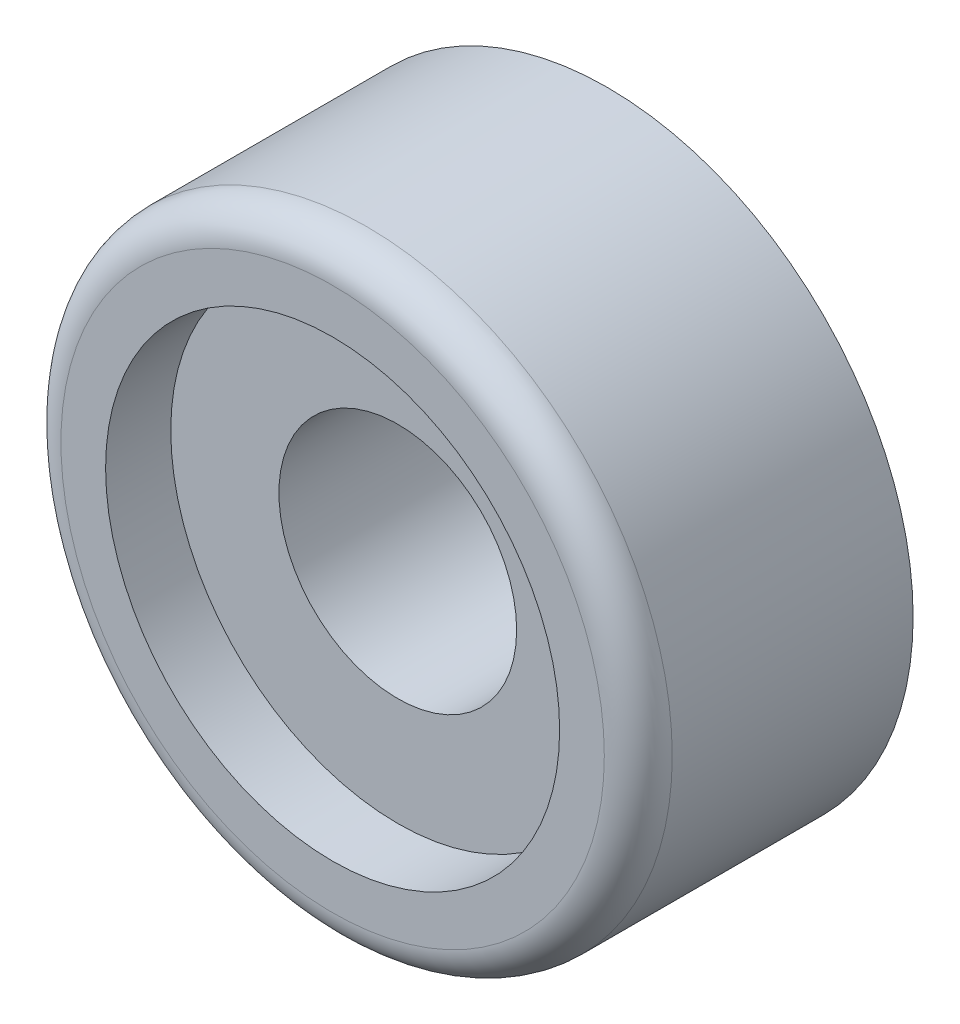
ISO-10303-21;
HEADER;
FILE_DESCRIPTION(('STEP AP214'),'2;1');
FILE_NAME('part.step','',(''),(''),'','','');
FILE_SCHEMA(('AUTOMOTIVE_DESIGN { 1 0 10303 214 1 1 1 1 }'));
ENDSEC;
DATA;
#1=APPLICATION_CONTEXT('core data for automotive mechanical design processes');
#2=APPLICATION_PROTOCOL_DEFINITION('international standard','automotive_design',2000,#1);
#3=PRODUCT_CONTEXT('',#1,'mechanical');
#4=PRODUCT('Part','Part','',(#3));
#5=PRODUCT_RELATED_PRODUCT_CATEGORY('part','',(#4));
#6=PRODUCT_DEFINITION_FORMATION('','',#4);
#7=PRODUCT_DEFINITION_CONTEXT('part definition',#1,'design');
#8=PRODUCT_DEFINITION('design','',#6,#7);
#9=PRODUCT_DEFINITION_SHAPE('','',#8);
#10=(LENGTH_UNIT() NAMED_UNIT(*) SI_UNIT(.MILLI.,.METRE.));
#11=(NAMED_UNIT(*) PLANE_ANGLE_UNIT() SI_UNIT($,.RADIAN.));
#12=(NAMED_UNIT(*) SI_UNIT($,.STERADIAN.) SOLID_ANGLE_UNIT());
#13=UNCERTAINTY_MEASURE_WITH_UNIT(LENGTH_MEASURE(1.E-05),#10,'distance_accuracy_value','');
#14=(GEOMETRIC_REPRESENTATION_CONTEXT(3) GLOBAL_UNCERTAINTY_ASSIGNED_CONTEXT((#13)) GLOBAL_UNIT_ASSIGNED_CONTEXT((#10,
#11,#12)) REPRESENTATION_CONTEXT('',''));
#15=CARTESIAN_POINT('',(0.,0.,0.));
#16=DIRECTION('',(0.,0.,1.));
#17=DIRECTION('',(1.,0.,0.));
#18=AXIS2_PLACEMENT_3D('',#15,#16,#17);
#19=CARTESIAN_POINT('',(0.,0.,3.08679496690815));
#20=DIRECTION('',(0.,0.,1.));
#21=DIRECTION('',(1.,0.,0.));
#22=AXIS2_PLACEMENT_3D('',#19,#20,#21);
#23=CYLINDRICAL_SURFACE('',#22,3.34215319509846);
#24=CARTESIAN_POINT('',(0.,0.,4.04614604802376));
#25=DIRECTION('',(0.,0.,1.));
#26=DIRECTION('',(1.,0.,0.));
#27=AXIS2_PLACEMENT_3D('',#24,#25,#26);
#28=CIRCLE('',#27,3.34215319509846);
#29=CARTESIAN_POINT('',(3.34215319509846,0.,4.04614604802376));
#30=VERTEX_POINT('',#29);
#31=EDGE_CURVE('E40',#30,#30,#28,.F.);
#32=ORIENTED_EDGE('',*,*,#31,.F.);
#33=EDGE_LOOP('',(#32));
#34=FACE_BOUND('',#33,.T.);
#35=CARTESIAN_POINT('',(0.,0.,3.08679496690815));
#36=DIRECTION('',(0.,0.,1.));
#37=DIRECTION('',(1.,0.,0.));
#38=AXIS2_PLACEMENT_3D('',#35,#36,#37);
#39=CIRCLE('',#38,3.34215319509846);
#40=CARTESIAN_POINT('',(3.34215319509846,0.,3.08679496690815));
#41=VERTEX_POINT('',#40);
#42=EDGE_CURVE('E18',#41,#41,#39,.F.);
#43=ORIENTED_EDGE('',*,*,#42,.T.);
#44=EDGE_LOOP('',(#43));
#45=FACE_BOUND('',#44,.T.);
#46=ADVANCED_FACE('F15',(#34,#45),#23,.F.);
#47=CARTESIAN_POINT('',(0.,0.,3.08679496690815));
#48=DIRECTION('',(0.,0.,-1.));
#49=DIRECTION('',(-1.,0.,0.));
#50=AXIS2_PLACEMENT_3D('',#47,#48,#49);
#51=PLANE('',#50);
#52=ORIENTED_EDGE('',*,*,#42,.F.);
#53=EDGE_LOOP('',(#52));
#54=FACE_BOUND('',#53,.T.);
#55=CARTESIAN_POINT('',(0.,0.,3.08679496690813));
#56=DIRECTION('',(0.,0.,1.));
#57=DIRECTION('',(1.,0.,0.));
#58=AXIS2_PLACEMENT_3D('',#55,#56,#57);
#59=CIRCLE('',#58,1.75);
#60=CARTESIAN_POINT('',(1.75,0.,3.08679496690813));
#61=VERTEX_POINT('',#60);
#62=EDGE_CURVE('E38',#61,#61,#59,.F.);
#63=ORIENTED_EDGE('',*,*,#62,.T.);
#64=EDGE_LOOP('',(#63));
#65=FACE_BOUND('',#64,.T.);
#66=ADVANCED_FACE('F48',(#54,#65),#51,.F.);
#67=CARTESIAN_POINT('',(0.,0.,4.04614604802378));
#68=DIRECTION('',(0.,0.,1.));
#69=DIRECTION('',(1.,0.,0.));
#70=AXIS2_PLACEMENT_3D('',#67,#68,#69);
#71=PLANE('',#70);
#72=ORIENTED_EDGE('',*,*,#31,.T.);
#73=EDGE_LOOP('',(#72));
#74=FACE_BOUND('',#73,.T.);
#75=CARTESIAN_POINT('',(0.,0.,4.04614604802378));
#76=DIRECTION('',(0.,0.,-1.));
#77=DIRECTION('',(1.,0.,0.));
#78=AXIS2_PLACEMENT_3D('',#75,#76,#77);
#79=CIRCLE('',#78,4.);
#80=CARTESIAN_POINT('',(4.,0.,4.04614604802378));
#81=VERTEX_POINT('',#80);
#82=EDGE_CURVE('E37',#81,#81,#79,.T.);
#83=ORIENTED_EDGE('',*,*,#82,.F.);
#84=EDGE_LOOP('',(#83));
#85=FACE_BOUND('',#84,.T.);
#86=ADVANCED_FACE('F51',(#74,#85),#71,.T.);
#87=CARTESIAN_POINT('',(0.,0.,-1.91320503309187));
#88=DIRECTION('',(0.,0.,1.));
#89=DIRECTION('',(1.,0.,0.));
#90=AXIS2_PLACEMENT_3D('',#87,#88,#89);
#91=CYLINDRICAL_SURFACE('',#90,1.75);
#92=CARTESIAN_POINT('',(0.,0.,0.));
#93=DIRECTION('',(0.,0.,1.));
#94=DIRECTION('',(1.,0.,0.));
#95=AXIS2_PLACEMENT_3D('',#92,#93,#94);
#96=CIRCLE('',#95,1.75);
#97=CARTESIAN_POINT('',(1.75,0.,0.));
#98=VERTEX_POINT('',#97);
#99=EDGE_CURVE('E27',#98,#98,#96,.F.);
#100=ORIENTED_EDGE('',*,*,#99,.T.);
#101=EDGE_LOOP('',(#100));
#102=FACE_BOUND('',#101,.T.);
#103=ORIENTED_EDGE('',*,*,#62,.F.);
#104=EDGE_LOOP('',(#103));
#105=FACE_BOUND('',#104,.T.);
#106=ADVANCED_FACE('F54',(#102,#105),#91,.F.);
#107=CARTESIAN_POINT('',(0.,0.,3.54614604802378));
#108=DIRECTION('',(0.,0.,1.));
#109=DIRECTION('',(1.,0.,0.));
#110=AXIS2_PLACEMENT_3D('',#107,#108,#109);
#111=TOROIDAL_SURFACE('',#110,4.,0.5);
#112=ORIENTED_EDGE('',*,*,#82,.T.);
#113=EDGE_LOOP('',(#112));
#114=FACE_BOUND('',#113,.T.);
#115=CARTESIAN_POINT('',(0.,0.,3.54614604802378));
#116=DIRECTION('',(0.,0.,-1.));
#117=DIRECTION('',(-1.,0.,0.));
#118=AXIS2_PLACEMENT_3D('',#115,#116,#117);
#119=CIRCLE('',#118,4.5);
#120=CARTESIAN_POINT('',(-4.5,0.,3.54614604802378));
#121=VERTEX_POINT('',#120);
#122=EDGE_CURVE('E22',#121,#121,#119,.T.);
#123=ORIENTED_EDGE('',*,*,#122,.F.);
#124=EDGE_LOOP('',(#123));
#125=FACE_BOUND('',#124,.T.);
#126=ADVANCED_FACE('F56',(#114,#125),#111,.T.);
#127=CARTESIAN_POINT('',(0.,0.,0.));
#128=DIRECTION('',(0.,0.,1.));
#129=DIRECTION('',(1.,0.,0.));
#130=AXIS2_PLACEMENT_3D('',#127,#128,#129);
#131=PLANE('',#130);
#132=ORIENTED_EDGE('',*,*,#99,.F.);
#133=EDGE_LOOP('',(#132));
#134=FACE_BOUND('',#133,.T.);
#135=CARTESIAN_POINT('',(0.,0.,0.));
#136=DIRECTION('',(0.,0.,-1.));
#137=DIRECTION('',(-1.,0.,0.));
#138=AXIS2_PLACEMENT_3D('',#135,#136,#137);
#139=CIRCLE('',#138,4.5);
#140=CARTESIAN_POINT('',(-4.5,0.,0.));
#141=VERTEX_POINT('',#140);
#142=EDGE_CURVE('E10',#141,#141,#139,.F.);
#143=ORIENTED_EDGE('',*,*,#142,.F.);
#144=EDGE_LOOP('',(#143));
#145=FACE_BOUND('',#144,.T.);
#146=ADVANCED_FACE('F64',(#134,#145),#131,.F.);
#147=CARTESIAN_POINT('',(0.,0.,4.04614604802378));
#148=DIRECTION('',(0.,0.,-1.));
#149=DIRECTION('',(-1.,0.,0.));
#150=AXIS2_PLACEMENT_3D('',#147,#148,#149);
#151=CYLINDRICAL_SURFACE('',#150,4.5);
#152=ORIENTED_EDGE('',*,*,#142,.T.);
#153=EDGE_LOOP('',(#152));
#154=FACE_BOUND('',#153,.T.);
#155=ORIENTED_EDGE('',*,*,#122,.T.);
#156=EDGE_LOOP('',(#155));
#157=FACE_BOUND('',#156,.T.);
#158=ADVANCED_FACE('F67',(#154,#157),#151,.T.);
#159=CLOSED_SHELL('',(#46,#66,#86,#106,#126,#146,#158));
#160=MANIFOLD_SOLID_BREP('B1',#159);
#161=ADVANCED_BREP_SHAPE_REPRESENTATION('',(#18,#160),#14);
#162=SHAPE_DEFINITION_REPRESENTATION(#9,#161);
ENDSEC;
END-ISO-10303-21;
